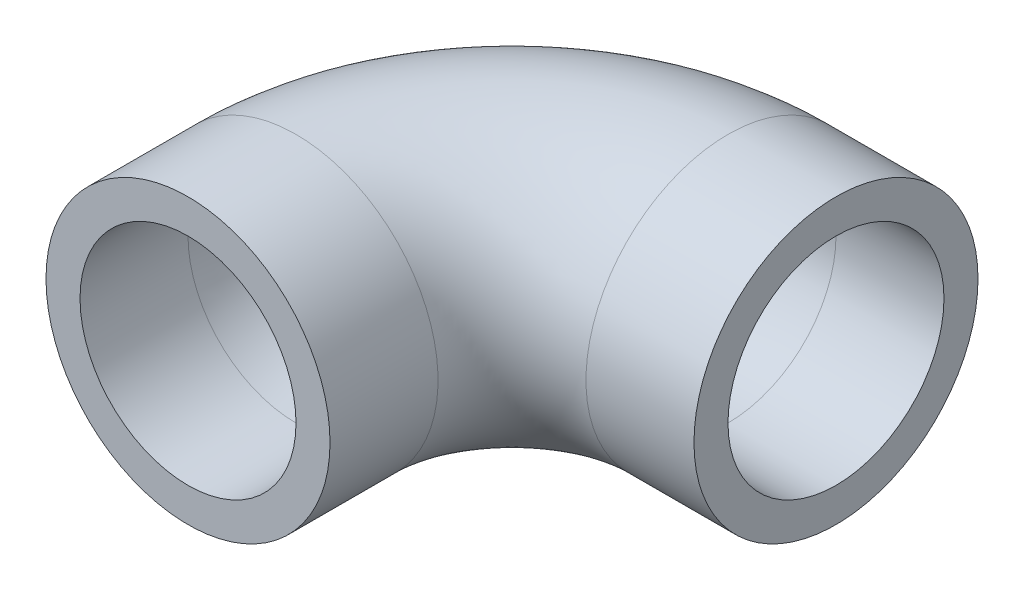
ISO-10303-21;
HEADER;
FILE_DESCRIPTION(('STEP AP214'),'2;1');
FILE_NAME('part.step','',(''),(''),'','','');
FILE_SCHEMA(('AUTOMOTIVE_DESIGN { 1 0 10303 214 1 1 1 1 }'));
ENDSEC;
DATA;
#1=APPLICATION_CONTEXT('core data for automotive mechanical design processes');
#2=APPLICATION_PROTOCOL_DEFINITION('international standard','automotive_design',2000,#1);
#3=PRODUCT_CONTEXT('',#1,'mechanical');
#4=PRODUCT('Part','Part','',(#3));
#5=PRODUCT_RELATED_PRODUCT_CATEGORY('part','',(#4));
#6=PRODUCT_DEFINITION_FORMATION('','',#4);
#7=PRODUCT_DEFINITION_CONTEXT('part definition',#1,'design');
#8=PRODUCT_DEFINITION('design','',#6,#7);
#9=PRODUCT_DEFINITION_SHAPE('','',#8);
#10=(LENGTH_UNIT() NAMED_UNIT(*) SI_UNIT(.MILLI.,.METRE.));
#11=(NAMED_UNIT(*) PLANE_ANGLE_UNIT() SI_UNIT($,.RADIAN.));
#12=(NAMED_UNIT(*) SI_UNIT($,.STERADIAN.) SOLID_ANGLE_UNIT());
#13=UNCERTAINTY_MEASURE_WITH_UNIT(LENGTH_MEASURE(1.E-05),#10,'distance_accuracy_value','');
#14=(GEOMETRIC_REPRESENTATION_CONTEXT(3) GLOBAL_UNCERTAINTY_ASSIGNED_CONTEXT((#13)) GLOBAL_UNIT_ASSIGNED_CONTEXT((#10,
#11,#12)) REPRESENTATION_CONTEXT('',''));
#15=CARTESIAN_POINT('',(0.,0.,0.));
#16=DIRECTION('',(0.,0.,1.));
#17=DIRECTION('',(1.,0.,0.));
#18=AXIS2_PLACEMENT_3D('',#15,#16,#17);
#19=CARTESIAN_POINT('',(0.,0.,0.));
#20=DIRECTION('',(0.,0.,-1.));
#21=DIRECTION('',(-1.,0.,0.));
#22=AXIS2_PLACEMENT_3D('',#19,#20,#21);
#23=CYLINDRICAL_SURFACE('',#22,16.7005);
#24=CARTESIAN_POINT('',(0.,0.,-12.7));
#25=DIRECTION('',(0.,0.,1.));
#26=DIRECTION('',(1.,0.,0.));
#27=AXIS2_PLACEMENT_3D('',#24,#25,#26);
#28=CIRCLE('',#27,16.7005);
#29=CARTESIAN_POINT('',(-16.7005,0.,-12.7));
#30=VERTEX_POINT('',#29);
#31=EDGE_CURVE('E98',#30,#30,#28,.T.);
#32=ORIENTED_EDGE('',*,*,#31,.T.);
#33=EDGE_LOOP('',(#32));
#34=FACE_BOUND('',#33,.T.);
#35=CARTESIAN_POINT('',(0.,0.,0.));
#36=DIRECTION('',(0.,0.,1.));
#37=DIRECTION('',(1.,0.,0.));
#38=AXIS2_PLACEMENT_3D('',#35,#36,#37);
#39=CIRCLE('',#38,16.7005);
#40=CARTESIAN_POINT('',(16.7005,0.,0.));
#41=VERTEX_POINT('',#40);
#42=EDGE_CURVE('E47',#41,#41,#39,.T.);
#43=ORIENTED_EDGE('',*,*,#42,.F.);
#44=EDGE_LOOP('',(#43));
#45=FACE_BOUND('',#44,.T.);
#46=ADVANCED_FACE('F32',(#34,#45),#23,.T.);
#47=CARTESIAN_POINT('',(25.4,0.,-12.7));
#48=DIRECTION('',(0.,-1.,0.));
#49=DIRECTION('',(0.,0.,-1.));
#50=AXIS2_PLACEMENT_3D('',#47,#48,#49);
#51=TOROIDAL_SURFACE('',#50,25.4,16.7005);
#52=CARTESIAN_POINT('',(25.4,0.,-38.1));
#53=DIRECTION('',(-1.,0.,0.));
#54=DIRECTION('',(0.,0.,1.));
#55=AXIS2_PLACEMENT_3D('',#52,#53,#54);
#56=CIRCLE('',#55,16.7005);
#57=CARTESIAN_POINT('',(25.4,0.,-54.8005));
#58=VERTEX_POINT('',#57);
#59=EDGE_CURVE('E36',#58,#58,#56,.T.);
#60=CARTESIAN_POINT('',(25.4,0.,-12.7));
#61=DIRECTION('',(0.,-1.,0.));
#62=DIRECTION('',(0.,0.,-1.));
#63=AXIS2_PLACEMENT_3D('',#60,#61,#62);
#64=CIRCLE('',#63,42.1005);
#65=EDGE_CURVE('',#30,#58,#64,.T.);
#66=ORIENTED_EDGE('',*,*,#31,.F.);
#67=ORIENTED_EDGE('',*,*,#59,.T.);
#68=ORIENTED_EDGE('',*,*,#65,.T.);
#69=ORIENTED_EDGE('',*,*,#65,.F.);
#70=EDGE_LOOP('',(#66,#68,#67,#69));
#71=FACE_BOUND('',#70,.T.);
#72=ADVANCED_FACE('F105',(#71),#51,.T.);
#73=CARTESIAN_POINT('',(25.4,0.,-38.1));
#74=DIRECTION('',(1.,0.,0.));
#75=DIRECTION('',(0.,0.,-1.));
#76=AXIS2_PLACEMENT_3D('',#73,#74,#75);
#77=CYLINDRICAL_SURFACE('',#76,16.7005);
#78=CARTESIAN_POINT('',(38.1,0.,-38.1));
#79=DIRECTION('',(-1.,0.,0.));
#80=DIRECTION('',(0.,0.,1.));
#81=AXIS2_PLACEMENT_3D('',#78,#79,#80);
#82=CIRCLE('',#81,16.7005);
#83=CARTESIAN_POINT('',(38.1,0.,-21.3995));
#84=VERTEX_POINT('',#83);
#85=EDGE_CURVE('E52',#84,#84,#82,.T.);
#86=ORIENTED_EDGE('',*,*,#85,.T.);
#87=EDGE_LOOP('',(#86));
#88=FACE_BOUND('',#87,.T.);
#89=ORIENTED_EDGE('',*,*,#59,.F.);
#90=EDGE_LOOP('',(#89));
#91=FACE_BOUND('',#90,.T.);
#92=ADVANCED_FACE('F34',(#88,#91),#77,.T.);
#93=CARTESIAN_POINT('',(0.,0.,0.));
#94=DIRECTION('',(0.,0.,1.));
#95=DIRECTION('',(1.,0.,0.));
#96=AXIS2_PLACEMENT_3D('',#93,#94,#95);
#97=PLANE('',#96);
#98=CARTESIAN_POINT('',(0.,0.,0.));
#99=DIRECTION('',(0.,0.,1.));
#100=DIRECTION('',(1.,0.,0.));
#101=AXIS2_PLACEMENT_3D('',#98,#99,#100);
#102=CIRCLE('',#101,12.7);
#103=CARTESIAN_POINT('',(12.7,0.,0.));
#104=VERTEX_POINT('',#103);
#105=EDGE_CURVE('E91',#104,#104,#102,.F.);
#106=ORIENTED_EDGE('',*,*,#105,.T.);
#107=EDGE_LOOP('',(#106));
#108=FACE_BOUND('',#107,.T.);
#109=ORIENTED_EDGE('',*,*,#42,.T.);
#110=EDGE_LOOP('',(#109));
#111=FACE_BOUND('',#110,.T.);
#112=ADVANCED_FACE('F65',(#108,#111),#97,.T.);
#113=CARTESIAN_POINT('',(38.1,0.,-38.1));
#114=DIRECTION('',(-1.,0.,0.));
#115=DIRECTION('',(0.,0.,1.));
#116=AXIS2_PLACEMENT_3D('',#113,#114,#115);
#117=PLANE('',#116);
#118=CARTESIAN_POINT('',(38.1,0.,-38.1));
#119=DIRECTION('',(-1.,0.,0.));
#120=DIRECTION('',(0.,0.,1.));
#121=AXIS2_PLACEMENT_3D('',#118,#119,#120);
#122=CIRCLE('',#121,12.7);
#123=CARTESIAN_POINT('',(38.1,0.,-25.4));
#124=VERTEX_POINT('',#123);
#125=EDGE_CURVE('E11',#124,#124,#122,.F.);
#126=ORIENTED_EDGE('',*,*,#125,.F.);
#127=EDGE_LOOP('',(#126));
#128=FACE_BOUND('',#127,.T.);
#129=ORIENTED_EDGE('',*,*,#85,.F.);
#130=EDGE_LOOP('',(#129));
#131=FACE_BOUND('',#130,.T.);
#132=ADVANCED_FACE('F62',(#128,#131),#117,.F.);
#133=CARTESIAN_POINT('',(0.,0.,0.));
#134=DIRECTION('',(0.,0.,-1.));
#135=DIRECTION('',(-1.,0.,0.));
#136=AXIS2_PLACEMENT_3D('',#133,#134,#135);
#137=CYLINDRICAL_SURFACE('',#136,12.7);
#138=CARTESIAN_POINT('',(0.,0.,-12.7));
#139=DIRECTION('',(0.,0.,1.));
#140=DIRECTION('',(1.,0.,0.));
#141=AXIS2_PLACEMENT_3D('',#138,#139,#140);
#142=CIRCLE('',#141,12.7);
#143=CARTESIAN_POINT('',(-12.7,0.,-12.7));
#144=VERTEX_POINT('',#143);
#145=EDGE_CURVE('E90',#144,#144,#142,.F.);
#146=ORIENTED_EDGE('',*,*,#145,.T.);
#147=EDGE_LOOP('',(#146));
#148=FACE_BOUND('',#147,.T.);
#149=ORIENTED_EDGE('',*,*,#105,.F.);
#150=EDGE_LOOP('',(#149));
#151=FACE_BOUND('',#150,.T.);
#152=ADVANCED_FACE('F64',(#148,#151),#137,.F.);
#153=CARTESIAN_POINT('',(25.4,0.,-12.7));
#154=DIRECTION('',(0.,-1.,0.));
#155=DIRECTION('',(0.,0.,-1.));
#156=AXIS2_PLACEMENT_3D('',#153,#154,#155);
#157=TOROIDAL_SURFACE('',#156,25.4,12.7);
#158=CARTESIAN_POINT('',(25.4,0.,-38.1));
#159=DIRECTION('',(-1.,0.,0.));
#160=DIRECTION('',(0.,0.,1.));
#161=AXIS2_PLACEMENT_3D('',#158,#159,#160);
#162=CIRCLE('',#161,12.7);
#163=CARTESIAN_POINT('',(25.4,0.,-50.8));
#164=VERTEX_POINT('',#163);
#165=EDGE_CURVE('E41',#164,#164,#162,.F.);
#166=CARTESIAN_POINT('',(25.4,0.,-12.7));
#167=DIRECTION('',(0.,-1.,0.));
#168=DIRECTION('',(0.,0.,-1.));
#169=AXIS2_PLACEMENT_3D('',#166,#167,#168);
#170=CIRCLE('',#169,38.1);
#171=EDGE_CURVE('',#144,#164,#170,.T.);
#172=ORIENTED_EDGE('',*,*,#145,.F.);
#173=ORIENTED_EDGE('',*,*,#165,.T.);
#174=ORIENTED_EDGE('',*,*,#171,.T.);
#175=ORIENTED_EDGE('',*,*,#171,.F.);
#176=EDGE_LOOP('',(#172,#174,#173,#175));
#177=FACE_BOUND('',#176,.T.);
#178=ADVANCED_FACE('F71',(#177),#157,.F.);
#179=CARTESIAN_POINT('',(25.4,0.,-38.1));
#180=DIRECTION('',(1.,0.,0.));
#181=DIRECTION('',(0.,0.,-1.));
#182=AXIS2_PLACEMENT_3D('',#179,#180,#181);
#183=CYLINDRICAL_SURFACE('',#182,12.7);
#184=ORIENTED_EDGE('',*,*,#125,.T.);
#185=EDGE_LOOP('',(#184));
#186=FACE_BOUND('',#185,.T.);
#187=ORIENTED_EDGE('',*,*,#165,.F.);
#188=EDGE_LOOP('',(#187));
#189=FACE_BOUND('',#188,.T.);
#190=ADVANCED_FACE('F59',(#186,#189),#183,.F.);
#191=CLOSED_SHELL('',(#46,#72,#92,#112,#132,#152,#178,#190));
#192=MANIFOLD_SOLID_BREP('B2',#191);
#193=ADVANCED_BREP_SHAPE_REPRESENTATION('',(#18,#192),#14);
#194=SHAPE_DEFINITION_REPRESENTATION(#9,#193);
ENDSEC;
END-ISO-10303-21;
